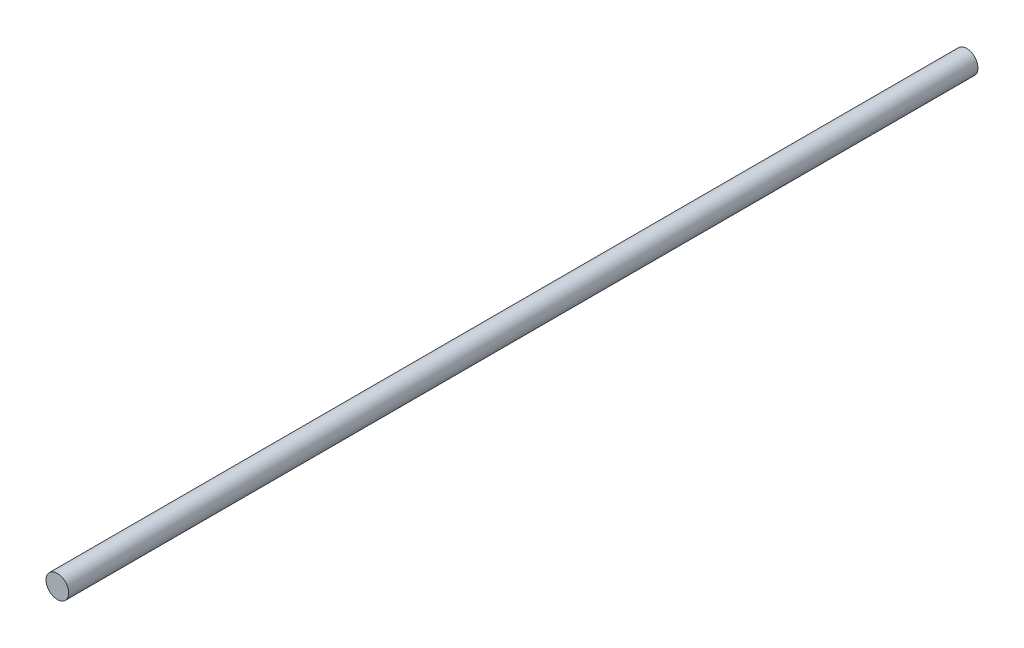
ISO-10303-21;
HEADER;
FILE_DESCRIPTION(('STEP AP214'),'2;1');
FILE_NAME('part.step','',(''),(''),'','','');
FILE_SCHEMA(('AUTOMOTIVE_DESIGN { 1 0 10303 214 1 1 1 1 }'));
ENDSEC;
DATA;
#1=APPLICATION_CONTEXT('core data for automotive mechanical design processes');
#2=APPLICATION_PROTOCOL_DEFINITION('international standard','automotive_design',2000,#1);
#3=PRODUCT_CONTEXT('',#1,'mechanical');
#4=PRODUCT('Part','Part','',(#3));
#5=PRODUCT_RELATED_PRODUCT_CATEGORY('part','',(#4));
#6=PRODUCT_DEFINITION_FORMATION('','',#4);
#7=PRODUCT_DEFINITION_CONTEXT('part definition',#1,'design');
#8=PRODUCT_DEFINITION('design','',#6,#7);
#9=PRODUCT_DEFINITION_SHAPE('','',#8);
#10=(LENGTH_UNIT() NAMED_UNIT(*) SI_UNIT(.MILLI.,.METRE.));
#11=(NAMED_UNIT(*) PLANE_ANGLE_UNIT() SI_UNIT($,.RADIAN.));
#12=(NAMED_UNIT(*) SI_UNIT($,.STERADIAN.) SOLID_ANGLE_UNIT());
#13=UNCERTAINTY_MEASURE_WITH_UNIT(LENGTH_MEASURE(1.E-05),#10,'distance_accuracy_value','');
#14=(GEOMETRIC_REPRESENTATION_CONTEXT(3) GLOBAL_UNCERTAINTY_ASSIGNED_CONTEXT((#13)) GLOBAL_UNIT_ASSIGNED_CONTEXT((#10,
#11,#12)) REPRESENTATION_CONTEXT('',''));
#15=CARTESIAN_POINT('',(0.,0.,0.));
#16=DIRECTION('',(0.,0.,1.));
#17=DIRECTION('',(1.,0.,0.));
#18=AXIS2_PLACEMENT_3D('',#15,#16,#17);
#19=CARTESIAN_POINT('',(0.,0.,100.));
#20=DIRECTION('',(0.,0.,-1.));
#21=DIRECTION('',(-1.,0.,0.));
#22=AXIS2_PLACEMENT_3D('',#19,#20,#21);
#23=CYLINDRICAL_SURFACE('',#22,1.25);
#24=CARTESIAN_POINT('',(0.,0.,100.));
#25=DIRECTION('',(0.,0.,1.));
#26=DIRECTION('',(1.,0.,0.));
#27=AXIS2_PLACEMENT_3D('',#24,#25,#26);
#28=CIRCLE('',#27,1.25);
#29=CARTESIAN_POINT('',(1.25,0.,100.));
#30=VERTEX_POINT('',#29);
#31=EDGE_CURVE('E10',#30,#30,#28,.T.);
#32=ORIENTED_EDGE('',*,*,#31,.F.);
#33=EDGE_LOOP('',(#32));
#34=FACE_BOUND('',#33,.T.);
#35=CARTESIAN_POINT('',(0.,0.,0.));
#36=DIRECTION('',(0.,0.,1.));
#37=DIRECTION('',(1.,0.,0.));
#38=AXIS2_PLACEMENT_3D('',#35,#36,#37);
#39=CIRCLE('',#38,1.25);
#40=CARTESIAN_POINT('',(1.25,0.,0.));
#41=VERTEX_POINT('',#40);
#42=EDGE_CURVE('E34',#41,#41,#39,.T.);
#43=ORIENTED_EDGE('',*,*,#42,.T.);
#44=EDGE_LOOP('',(#43));
#45=FACE_BOUND('',#44,.T.);
#46=ADVANCED_FACE('F31',(#34,#45),#23,.T.);
#47=CARTESIAN_POINT('',(0.,0.,100.));
#48=DIRECTION('',(0.,0.,1.));
#49=DIRECTION('',(1.,0.,0.));
#50=AXIS2_PLACEMENT_3D('',#47,#48,#49);
#51=PLANE('',#50);
#52=ORIENTED_EDGE('',*,*,#31,.T.);
#53=EDGE_LOOP('',(#52));
#54=FACE_BOUND('',#53,.T.);
#55=ADVANCED_FACE('F46',(#54),#51,.T.);
#56=CARTESIAN_POINT('',(0.,0.,0.));
#57=DIRECTION('',(0.,0.,1.));
#58=DIRECTION('',(1.,0.,0.));
#59=AXIS2_PLACEMENT_3D('',#56,#57,#58);
#60=PLANE('',#59);
#61=ORIENTED_EDGE('',*,*,#42,.F.);
#62=EDGE_LOOP('',(#61));
#63=FACE_BOUND('',#62,.T.);
#64=ADVANCED_FACE('F44',(#63),#60,.F.);
#65=CLOSED_SHELL('',(#46,#55,#64));
#66=MANIFOLD_SOLID_BREP('B2',#65);
#67=ADVANCED_BREP_SHAPE_REPRESENTATION('',(#18,#66),#14);
#68=SHAPE_DEFINITION_REPRESENTATION(#9,#67);
ENDSEC;
END-ISO-10303-21;
